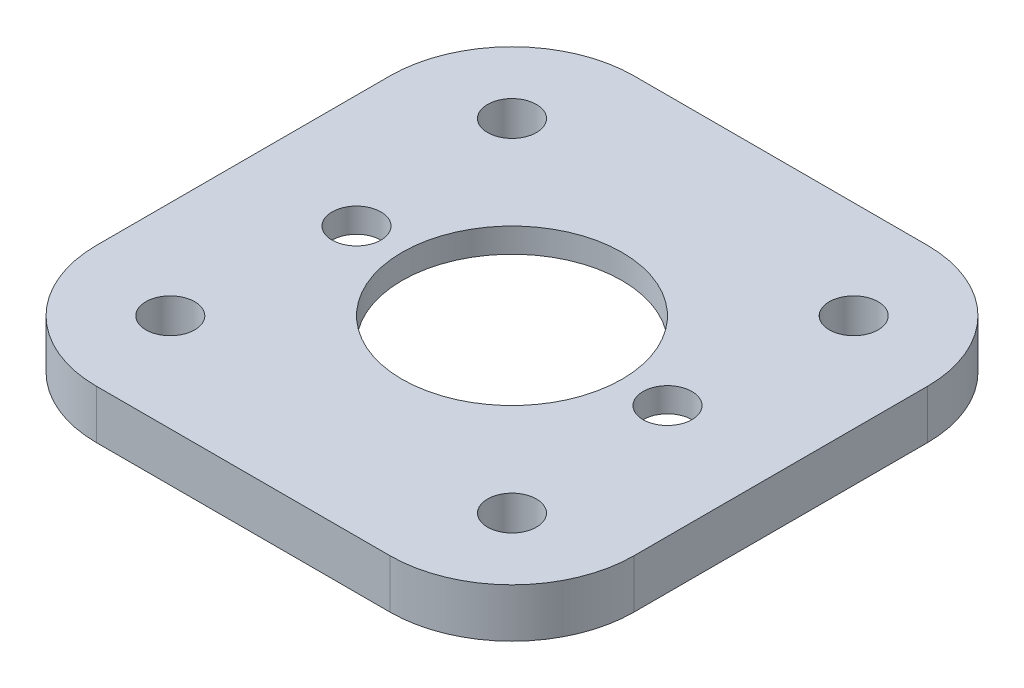
ISO-10303-21;
HEADER;
FILE_DESCRIPTION(('STEP AP214'),'2;1');
FILE_NAME('part.step','',(''),(''),'','','');
FILE_SCHEMA(('AUTOMOTIVE_DESIGN { 1 0 10303 214 1 1 1 1 }'));
ENDSEC;
DATA;
#1=APPLICATION_CONTEXT('core data for automotive mechanical design processes');
#2=APPLICATION_PROTOCOL_DEFINITION('international standard','automotive_design',2000,#1);
#3=PRODUCT_CONTEXT('',#1,'mechanical');
#4=PRODUCT('Part','Part','',(#3));
#5=PRODUCT_RELATED_PRODUCT_CATEGORY('part','',(#4));
#6=PRODUCT_DEFINITION_FORMATION('','',#4);
#7=PRODUCT_DEFINITION_CONTEXT('part definition',#1,'design');
#8=PRODUCT_DEFINITION('design','',#6,#7);
#9=PRODUCT_DEFINITION_SHAPE('','',#8);
#10=(LENGTH_UNIT() NAMED_UNIT(*) SI_UNIT(.MILLI.,.METRE.));
#11=(NAMED_UNIT(*) PLANE_ANGLE_UNIT() SI_UNIT($,.RADIAN.));
#12=(NAMED_UNIT(*) SI_UNIT($,.STERADIAN.) SOLID_ANGLE_UNIT());
#13=UNCERTAINTY_MEASURE_WITH_UNIT(LENGTH_MEASURE(1.E-05),#10,'distance_accuracy_value','');
#14=(GEOMETRIC_REPRESENTATION_CONTEXT(3) GLOBAL_UNCERTAINTY_ASSIGNED_CONTEXT((#13)) GLOBAL_UNIT_ASSIGNED_CONTEXT((#10,
#11,#12)) REPRESENTATION_CONTEXT('',''));
#15=CARTESIAN_POINT('',(0.,0.,0.));
#16=DIRECTION('',(0.,0.,1.));
#17=DIRECTION('',(1.,0.,0.));
#18=AXIS2_PLACEMENT_3D('',#15,#16,#17);
#19=CARTESIAN_POINT('',(0.,2.,-11.));
#20=DIRECTION('',(0.,0.,-1.));
#21=DIRECTION('',(-1.,0.,0.));
#22=AXIS2_PLACEMENT_3D('',#19,#20,#21);
#23=PLANE('',#22);
#24=DIRECTION('',(1.,0.,0.));
#25=VECTOR('',#24,1.);
#26=CARTESIAN_POINT('',(0.,0.,-11.));
#27=LINE('',#26,#25);
#28=CARTESIAN_POINT('',(-6.,0.,-11.));
#29=VERTEX_POINT('',#28);
#30=CARTESIAN_POINT('',(6.,0.,-11.));
#31=VERTEX_POINT('',#30);
#32=EDGE_CURVE('E169',#29,#31,#27,.T.);
#33=ORIENTED_EDGE('',*,*,#32,.F.);
#34=DIRECTION('',(0.,-1.,0.));
#35=VECTOR('',#34,1.);
#36=CARTESIAN_POINT('',(-6.,2.,-11.));
#37=LINE('',#36,#35);
#38=CARTESIAN_POINT('',(-6.,2.,-11.));
#39=VERTEX_POINT('',#38);
#40=EDGE_CURVE('E11',#39,#29,#37,.T.);
#41=ORIENTED_EDGE('',*,*,#40,.F.);
#42=DIRECTION('',(1.,0.,0.));
#43=VECTOR('',#42,1.);
#44=CARTESIAN_POINT('',(0.,2.,-11.));
#45=LINE('',#44,#43);
#46=CARTESIAN_POINT('',(6.,2.,-11.));
#47=VERTEX_POINT('',#46);
#48=EDGE_CURVE('E531',#39,#47,#45,.T.);
#49=ORIENTED_EDGE('',*,*,#48,.T.);
#50=DIRECTION('',(0.,-1.,0.));
#51=VECTOR('',#50,1.);
#52=CARTESIAN_POINT('',(6.,2.,-11.));
#53=LINE('',#52,#51);
#54=EDGE_CURVE('E63',#47,#31,#53,.T.);
#55=ORIENTED_EDGE('',*,*,#54,.T.);
#56=EDGE_LOOP('',(#33,#41,#49,#55));
#57=FACE_BOUND('',#56,.T.);
#58=ADVANCED_FACE('F39',(#57),#23,.T.);
#59=CARTESIAN_POINT('',(-6.,2.,-6.));
#60=DIRECTION('',(0.,-1.,0.));
#61=DIRECTION('',(0.,0.,-1.));
#62=AXIS2_PLACEMENT_3D('',#59,#60,#61);
#63=CYLINDRICAL_SURFACE('',#62,5.);
#64=CARTESIAN_POINT('',(-6.,0.,-6.));
#65=DIRECTION('',(0.,1.,0.));
#66=DIRECTION('',(0.,0.,1.));
#67=AXIS2_PLACEMENT_3D('',#64,#65,#66);
#68=CIRCLE('',#67,5.);
#69=CARTESIAN_POINT('',(-11.,0.,-6.));
#70=VERTEX_POINT('',#69);
#71=EDGE_CURVE('E171',#29,#70,#68,.T.);
#72=ORIENTED_EDGE('',*,*,#71,.T.);
#73=DIRECTION('',(0.,-1.,0.));
#74=VECTOR('',#73,1.);
#75=CARTESIAN_POINT('',(-11.,2.,-6.));
#76=LINE('',#75,#74);
#77=CARTESIAN_POINT('',(-11.,2.,-6.));
#78=VERTEX_POINT('',#77);
#79=EDGE_CURVE('E47',#78,#70,#76,.T.);
#80=ORIENTED_EDGE('',*,*,#79,.F.);
#81=CARTESIAN_POINT('',(-6.,2.,-6.));
#82=DIRECTION('',(0.,1.,0.));
#83=DIRECTION('',(0.,0.,1.));
#84=AXIS2_PLACEMENT_3D('',#81,#82,#83);
#85=CIRCLE('',#84,5.);
#86=EDGE_CURVE('E533',#39,#78,#85,.T.);
#87=ORIENTED_EDGE('',*,*,#86,.F.);
#88=ORIENTED_EDGE('',*,*,#40,.T.);
#89=EDGE_LOOP('',(#72,#80,#87,#88));
#90=FACE_BOUND('',#89,.T.);
#91=ADVANCED_FACE('F208',(#90),#63,.T.);
#92=CARTESIAN_POINT('',(-11.,2.,0.));
#93=DIRECTION('',(1.,0.,0.));
#94=DIRECTION('',(0.,0.,-1.));
#95=AXIS2_PLACEMENT_3D('',#92,#93,#94);
#96=PLANE('',#95);
#97=DIRECTION('',(0.,0.,1.));
#98=VECTOR('',#97,1.);
#99=CARTESIAN_POINT('',(-11.,0.,0.));
#100=LINE('',#99,#98);
#101=CARTESIAN_POINT('',(-11.,0.,6.));
#102=VERTEX_POINT('',#101);
#103=EDGE_CURVE('E174',#70,#102,#100,.T.);
#104=ORIENTED_EDGE('',*,*,#103,.T.);
#105=DIRECTION('',(0.,-1.,0.));
#106=VECTOR('',#105,1.);
#107=CARTESIAN_POINT('',(-11.,2.,6.));
#108=LINE('',#107,#106);
#109=CARTESIAN_POINT('',(-11.,2.,6.));
#110=VERTEX_POINT('',#109);
#111=EDGE_CURVE('E196',#110,#102,#108,.T.);
#112=ORIENTED_EDGE('',*,*,#111,.F.);
#113=DIRECTION('',(0.,0.,1.));
#114=VECTOR('',#113,1.);
#115=CARTESIAN_POINT('',(-11.,2.,0.));
#116=LINE('',#115,#114);
#117=EDGE_CURVE('E204',#78,#110,#116,.T.);
#118=ORIENTED_EDGE('',*,*,#117,.F.);
#119=ORIENTED_EDGE('',*,*,#79,.T.);
#120=EDGE_LOOP('',(#104,#112,#118,#119));
#121=FACE_BOUND('',#120,.T.);
#122=ADVANCED_FACE('F201',(#121),#96,.F.);
#123=CARTESIAN_POINT('',(-6.,2.,6.));
#124=DIRECTION('',(0.,-1.,0.));
#125=DIRECTION('',(0.,0.,-1.));
#126=AXIS2_PLACEMENT_3D('',#123,#124,#125);
#127=CYLINDRICAL_SURFACE('',#126,5.);
#128=CARTESIAN_POINT('',(-6.,0.,6.));
#129=DIRECTION('',(0.,1.,0.));
#130=DIRECTION('',(0.,0.,1.));
#131=AXIS2_PLACEMENT_3D('',#128,#129,#130);
#132=CIRCLE('',#131,5.);
#133=CARTESIAN_POINT('',(-6.,0.,11.));
#134=VERTEX_POINT('',#133);
#135=EDGE_CURVE('E177',#102,#134,#132,.T.);
#136=ORIENTED_EDGE('',*,*,#135,.T.);
#137=DIRECTION('',(0.,-1.,0.));
#138=VECTOR('',#137,1.);
#139=CARTESIAN_POINT('',(-6.,2.,11.));
#140=LINE('',#139,#138);
#141=CARTESIAN_POINT('',(-6.,2.,11.));
#142=VERTEX_POINT('',#141);
#143=EDGE_CURVE('E193',#142,#134,#140,.T.);
#144=ORIENTED_EDGE('',*,*,#143,.F.);
#145=CARTESIAN_POINT('',(-6.,2.,6.));
#146=DIRECTION('',(0.,1.,0.));
#147=DIRECTION('',(0.,0.,1.));
#148=AXIS2_PLACEMENT_3D('',#145,#146,#147);
#149=CIRCLE('',#148,5.);
#150=EDGE_CURVE('E536',#110,#142,#149,.T.);
#151=ORIENTED_EDGE('',*,*,#150,.F.);
#152=ORIENTED_EDGE('',*,*,#111,.T.);
#153=EDGE_LOOP('',(#136,#144,#151,#152));
#154=FACE_BOUND('',#153,.T.);
#155=ADVANCED_FACE('F282',(#154),#127,.T.);
#156=CARTESIAN_POINT('',(0.,2.,11.));
#157=DIRECTION('',(0.,0.,-1.));
#158=DIRECTION('',(-1.,0.,0.));
#159=AXIS2_PLACEMENT_3D('',#156,#157,#158);
#160=PLANE('',#159);
#161=DIRECTION('',(1.,0.,0.));
#162=VECTOR('',#161,1.);
#163=CARTESIAN_POINT('',(0.,0.,11.));
#164=LINE('',#163,#162);
#165=CARTESIAN_POINT('',(6.,0.,11.));
#166=VERTEX_POINT('',#165);
#167=EDGE_CURVE('E180',#134,#166,#164,.T.);
#168=ORIENTED_EDGE('',*,*,#167,.T.);
#169=DIRECTION('',(0.,-1.,0.));
#170=VECTOR('',#169,1.);
#171=CARTESIAN_POINT('',(6.,2.,11.));
#172=LINE('',#171,#170);
#173=CARTESIAN_POINT('',(6.,2.,11.));
#174=VERTEX_POINT('',#173);
#175=EDGE_CURVE('E138',#174,#166,#172,.T.);
#176=ORIENTED_EDGE('',*,*,#175,.F.);
#177=DIRECTION('',(1.,0.,0.));
#178=VECTOR('',#177,1.);
#179=CARTESIAN_POINT('',(0.,2.,11.));
#180=LINE('',#179,#178);
#181=EDGE_CURVE('E126',#142,#174,#180,.T.);
#182=ORIENTED_EDGE('',*,*,#181,.F.);
#183=ORIENTED_EDGE('',*,*,#143,.T.);
#184=EDGE_LOOP('',(#168,#176,#182,#183));
#185=FACE_BOUND('',#184,.T.);
#186=ADVANCED_FACE('F279',(#185),#160,.F.);
#187=CARTESIAN_POINT('',(6.,2.,6.));
#188=DIRECTION('',(0.,-1.,0.));
#189=DIRECTION('',(0.,0.,-1.));
#190=AXIS2_PLACEMENT_3D('',#187,#188,#189);
#191=CYLINDRICAL_SURFACE('',#190,5.);
#192=CARTESIAN_POINT('',(6.,0.,6.));
#193=DIRECTION('',(0.,1.,0.));
#194=DIRECTION('',(0.,0.,1.));
#195=AXIS2_PLACEMENT_3D('',#192,#193,#194);
#196=CIRCLE('',#195,5.);
#197=CARTESIAN_POINT('',(11.,0.,6.));
#198=VERTEX_POINT('',#197);
#199=EDGE_CURVE('E134',#166,#198,#196,.T.);
#200=ORIENTED_EDGE('',*,*,#199,.T.);
#201=DIRECTION('',(0.,-1.,0.));
#202=VECTOR('',#201,1.);
#203=CARTESIAN_POINT('',(11.,2.,6.));
#204=LINE('',#203,#202);
#205=CARTESIAN_POINT('',(11.,2.,6.));
#206=VERTEX_POINT('',#205);
#207=EDGE_CURVE('E132',#206,#198,#204,.T.);
#208=ORIENTED_EDGE('',*,*,#207,.F.);
#209=CARTESIAN_POINT('',(6.,2.,6.));
#210=DIRECTION('',(0.,1.,0.));
#211=DIRECTION('',(0.,0.,1.));
#212=AXIS2_PLACEMENT_3D('',#209,#210,#211);
#213=CIRCLE('',#212,5.);
#214=EDGE_CURVE('E117',#174,#206,#213,.T.);
#215=ORIENTED_EDGE('',*,*,#214,.F.);
#216=ORIENTED_EDGE('',*,*,#175,.T.);
#217=EDGE_LOOP('',(#200,#208,#215,#216));
#218=FACE_BOUND('',#217,.T.);
#219=ADVANCED_FACE('F133',(#218),#191,.T.);
#220=CARTESIAN_POINT('',(11.,2.,0.));
#221=DIRECTION('',(1.,0.,0.));
#222=DIRECTION('',(0.,0.,-1.));
#223=AXIS2_PLACEMENT_3D('',#220,#221,#222);
#224=PLANE('',#223);
#225=DIRECTION('',(0.,0.,1.));
#226=VECTOR('',#225,1.);
#227=CARTESIAN_POINT('',(11.,0.,0.));
#228=LINE('',#227,#226);
#229=CARTESIAN_POINT('',(11.,0.,-6.));
#230=VERTEX_POINT('',#229);
#231=EDGE_CURVE('E184',#230,#198,#228,.T.);
#232=ORIENTED_EDGE('',*,*,#231,.F.);
#233=DIRECTION('',(0.,-1.,0.));
#234=VECTOR('',#233,1.);
#235=CARTESIAN_POINT('',(11.,2.,-6.));
#236=LINE('',#235,#234);
#237=CARTESIAN_POINT('',(11.,2.,-6.));
#238=VERTEX_POINT('',#237);
#239=EDGE_CURVE('E139',#238,#230,#236,.T.);
#240=ORIENTED_EDGE('',*,*,#239,.F.);
#241=DIRECTION('',(0.,0.,1.));
#242=VECTOR('',#241,1.);
#243=CARTESIAN_POINT('',(11.,2.,0.));
#244=LINE('',#243,#242);
#245=EDGE_CURVE('E124',#238,#206,#244,.T.);
#246=ORIENTED_EDGE('',*,*,#245,.T.);
#247=ORIENTED_EDGE('',*,*,#207,.T.);
#248=EDGE_LOOP('',(#232,#240,#246,#247));
#249=FACE_BOUND('',#248,.T.);
#250=ADVANCED_FACE('F141',(#249),#224,.T.);
#251=CARTESIAN_POINT('',(-6.36396103067893,2.,0.));
#252=DIRECTION('',(0.,-1.,0.));
#253=DIRECTION('',(0.,0.,-1.));
#254=AXIS2_PLACEMENT_3D('',#251,#252,#253);
#255=CYLINDRICAL_SURFACE('',#254,1.);
#256=CARTESIAN_POINT('',(-6.36396103067893,1.,0.));
#257=DIRECTION('',(0.,1.,0.));
#258=DIRECTION('',(0.,0.,1.));
#259=AXIS2_PLACEMENT_3D('',#256,#257,#258);
#260=CIRCLE('',#259,1.);
#261=CARTESIAN_POINT('',(-6.36396103067893,1.,0.999999999999975));
#262=VERTEX_POINT('',#261);
#263=EDGE_CURVE('E451',#262,#262,#260,.T.);
#264=ORIENTED_EDGE('',*,*,#263,.F.);
#265=EDGE_LOOP('',(#264));
#266=FACE_BOUND('',#265,.T.);
#267=CARTESIAN_POINT('',(-6.36396103067893,2.,0.));
#268=DIRECTION('',(0.,1.,0.));
#269=DIRECTION('',(0.,0.,1.));
#270=AXIS2_PLACEMENT_3D('',#267,#268,#269);
#271=CIRCLE('',#270,1.);
#272=CARTESIAN_POINT('',(-6.36396103067893,2.,0.999999999999975));
#273=VERTEX_POINT('',#272);
#274=EDGE_CURVE('E150',#273,#273,#271,.T.);
#275=ORIENTED_EDGE('',*,*,#274,.T.);
#276=EDGE_LOOP('',(#275));
#277=FACE_BOUND('',#276,.T.);
#278=ADVANCED_FACE('F265',(#266,#277),#255,.F.);
#279=CARTESIAN_POINT('',(6.36396103067892,2.,0.));
#280=DIRECTION('',(0.,-1.,0.));
#281=DIRECTION('',(0.,0.,-1.));
#282=AXIS2_PLACEMENT_3D('',#279,#280,#281);
#283=CYLINDRICAL_SURFACE('',#282,1.);
#284=CARTESIAN_POINT('',(6.36396103067892,1.,0.));
#285=DIRECTION('',(0.,1.,0.));
#286=DIRECTION('',(0.,0.,1.));
#287=AXIS2_PLACEMENT_3D('',#284,#285,#286);
#288=CIRCLE('',#287,1.);
#289=CARTESIAN_POINT('',(6.36396103067892,1.,0.999999999999973));
#290=VERTEX_POINT('',#289);
#291=EDGE_CURVE('E447',#290,#290,#288,.T.);
#292=ORIENTED_EDGE('',*,*,#291,.F.);
#293=EDGE_LOOP('',(#292));
#294=FACE_BOUND('',#293,.T.);
#295=CARTESIAN_POINT('',(6.36396103067892,2.,0.));
#296=DIRECTION('',(0.,1.,0.));
#297=DIRECTION('',(0.,0.,1.));
#298=AXIS2_PLACEMENT_3D('',#295,#296,#297);
#299=CIRCLE('',#298,1.);
#300=CARTESIAN_POINT('',(6.36396103067892,2.,0.999999999999973));
#301=VERTEX_POINT('',#300);
#302=EDGE_CURVE('E144',#301,#301,#299,.T.);
#303=ORIENTED_EDGE('',*,*,#302,.T.);
#304=EDGE_LOOP('',(#303));
#305=FACE_BOUND('',#304,.T.);
#306=ADVANCED_FACE('F268',(#294,#305),#283,.F.);
#307=CARTESIAN_POINT('',(6.,2.,-6.));
#308=DIRECTION('',(0.,-1.,0.));
#309=DIRECTION('',(0.,0.,-1.));
#310=AXIS2_PLACEMENT_3D('',#307,#308,#309);
#311=CYLINDRICAL_SURFACE('',#310,5.);
#312=CARTESIAN_POINT('',(6.,0.,-6.));
#313=DIRECTION('',(0.,1.,0.));
#314=DIRECTION('',(0.,0.,1.));
#315=AXIS2_PLACEMENT_3D('',#312,#313,#314);
#316=CIRCLE('',#315,5.);
#317=EDGE_CURVE('E186',#31,#230,#316,.F.);
#318=ORIENTED_EDGE('',*,*,#317,.F.);
#319=ORIENTED_EDGE('',*,*,#54,.F.);
#320=CARTESIAN_POINT('',(6.,2.,-6.));
#321=DIRECTION('',(0.,1.,0.));
#322=DIRECTION('',(0.,0.,1.));
#323=AXIS2_PLACEMENT_3D('',#320,#321,#322);
#324=CIRCLE('',#323,5.);
#325=EDGE_CURVE('E142',#47,#238,#324,.F.);
#326=ORIENTED_EDGE('',*,*,#325,.T.);
#327=ORIENTED_EDGE('',*,*,#239,.T.);
#328=EDGE_LOOP('',(#318,#319,#326,#327));
#329=FACE_BOUND('',#328,.T.);
#330=ADVANCED_FACE('F223',(#329),#311,.T.);
#331=CARTESIAN_POINT('',(-6.99222187730034,2.,6.99222187730034));
#332=DIRECTION('',(0.,-1.,0.));
#333=DIRECTION('',(0.,0.,-1.));
#334=AXIS2_PLACEMENT_3D('',#331,#332,#333);
#335=CYLINDRICAL_SURFACE('',#334,1.);
#336=CARTESIAN_POINT('',(-6.99222187730034,2.,6.99222187730034));
#337=DIRECTION('',(0.,1.,0.));
#338=DIRECTION('',(0.,0.,1.));
#339=AXIS2_PLACEMENT_3D('',#336,#337,#338);
#340=CIRCLE('',#339,1.);
#341=CARTESIAN_POINT('',(-6.99222187730034,2.,7.99222187730034));
#342=VERTEX_POINT('',#341);
#343=EDGE_CURVE('E528',#342,#342,#340,.T.);
#344=ORIENTED_EDGE('',*,*,#343,.T.);
#345=EDGE_LOOP('',(#344));
#346=FACE_BOUND('',#345,.T.);
#347=CARTESIAN_POINT('',(-6.99222187730034,0.,6.99222187730034));
#348=DIRECTION('',(0.,1.,0.));
#349=DIRECTION('',(0.,0.,1.));
#350=AXIS2_PLACEMENT_3D('',#347,#348,#349);
#351=CIRCLE('',#350,1.);
#352=CARTESIAN_POINT('',(-6.99222187730034,0.,7.99222187730034));
#353=VERTEX_POINT('',#352);
#354=EDGE_CURVE('E166',#353,#353,#351,.T.);
#355=ORIENTED_EDGE('',*,*,#354,.F.);
#356=EDGE_LOOP('',(#355));
#357=FACE_BOUND('',#356,.T.);
#358=ADVANCED_FACE('F219',(#346,#357),#335,.F.);
#359=CARTESIAN_POINT('',(6.99222187730034,2.,6.99222187730034));
#360=DIRECTION('',(0.,-1.,0.));
#361=DIRECTION('',(0.,0.,-1.));
#362=AXIS2_PLACEMENT_3D('',#359,#360,#361);
#363=CYLINDRICAL_SURFACE('',#362,1.);
#364=CARTESIAN_POINT('',(6.99222187730034,2.,6.99222187730034));
#365=DIRECTION('',(0.,1.,0.));
#366=DIRECTION('',(0.,0.,1.));
#367=AXIS2_PLACEMENT_3D('',#364,#365,#366);
#368=CIRCLE('',#367,1.);
#369=CARTESIAN_POINT('',(6.99222187730034,2.,7.99222187730034));
#370=VERTEX_POINT('',#369);
#371=EDGE_CURVE('E525',#370,#370,#368,.T.);
#372=ORIENTED_EDGE('',*,*,#371,.T.);
#373=EDGE_LOOP('',(#372));
#374=FACE_BOUND('',#373,.T.);
#375=CARTESIAN_POINT('',(6.99222187730034,0.,6.99222187730034));
#376=DIRECTION('',(0.,1.,0.));
#377=DIRECTION('',(0.,0.,1.));
#378=AXIS2_PLACEMENT_3D('',#375,#376,#377);
#379=CIRCLE('',#378,1.);
#380=CARTESIAN_POINT('',(6.99222187730034,0.,7.99222187730034));
#381=VERTEX_POINT('',#380);
#382=EDGE_CURVE('E163',#381,#381,#379,.T.);
#383=ORIENTED_EDGE('',*,*,#382,.F.);
#384=EDGE_LOOP('',(#383));
#385=FACE_BOUND('',#384,.T.);
#386=ADVANCED_FACE('F222',(#374,#385),#363,.F.);
#387=CARTESIAN_POINT('',(6.99222187730034,2.,-6.99222187730033));
#388=DIRECTION('',(0.,-1.,0.));
#389=DIRECTION('',(0.,0.,-1.));
#390=AXIS2_PLACEMENT_3D('',#387,#388,#389);
#391=CYLINDRICAL_SURFACE('',#390,1.);
#392=CARTESIAN_POINT('',(6.99222187730034,2.,-6.99222187730033));
#393=DIRECTION('',(0.,1.,0.));
#394=DIRECTION('',(0.,0.,1.));
#395=AXIS2_PLACEMENT_3D('',#392,#393,#394);
#396=CIRCLE('',#395,1.);
#397=CARTESIAN_POINT('',(6.99222187730034,2.,-5.99222187730033));
#398=VERTEX_POINT('',#397);
#399=EDGE_CURVE('E238',#398,#398,#396,.T.);
#400=ORIENTED_EDGE('',*,*,#399,.T.);
#401=EDGE_LOOP('',(#400));
#402=FACE_BOUND('',#401,.T.);
#403=CARTESIAN_POINT('',(6.99222187730034,0.,-6.99222187730033));
#404=DIRECTION('',(0.,1.,0.));
#405=DIRECTION('',(0.,0.,1.));
#406=AXIS2_PLACEMENT_3D('',#403,#404,#405);
#407=CIRCLE('',#406,1.);
#408=CARTESIAN_POINT('',(6.99222187730034,0.,-5.99222187730033));
#409=VERTEX_POINT('',#408);
#410=EDGE_CURVE('E159',#409,#409,#407,.T.);
#411=ORIENTED_EDGE('',*,*,#410,.F.);
#412=EDGE_LOOP('',(#411));
#413=FACE_BOUND('',#412,.T.);
#414=ADVANCED_FACE('F226',(#402,#413),#391,.F.);
#415=CARTESIAN_POINT('',(-6.99222187730034,2.,-6.99222187730034));
#416=DIRECTION('',(0.,-1.,0.));
#417=DIRECTION('',(0.,0.,-1.));
#418=AXIS2_PLACEMENT_3D('',#415,#416,#417);
#419=CYLINDRICAL_SURFACE('',#418,1.);
#420=CARTESIAN_POINT('',(-6.99222187730034,2.,-6.99222187730034));
#421=DIRECTION('',(0.,1.,0.));
#422=DIRECTION('',(0.,0.,1.));
#423=AXIS2_PLACEMENT_3D('',#420,#421,#422);
#424=CIRCLE('',#423,1.);
#425=CARTESIAN_POINT('',(-6.99222187730034,2.,-5.99222187730034));
#426=VERTEX_POINT('',#425);
#427=EDGE_CURVE('E189',#426,#426,#424,.T.);
#428=ORIENTED_EDGE('',*,*,#427,.T.);
#429=EDGE_LOOP('',(#428));
#430=FACE_BOUND('',#429,.T.);
#431=CARTESIAN_POINT('',(-6.99222187730034,0.,-6.99222187730034));
#432=DIRECTION('',(0.,1.,0.));
#433=DIRECTION('',(0.,0.,1.));
#434=AXIS2_PLACEMENT_3D('',#431,#432,#433);
#435=CIRCLE('',#434,1.);
#436=CARTESIAN_POINT('',(-6.99222187730034,0.,-5.99222187730034));
#437=VERTEX_POINT('',#436);
#438=EDGE_CURVE('E156',#437,#437,#435,.T.);
#439=ORIENTED_EDGE('',*,*,#438,.F.);
#440=EDGE_LOOP('',(#439));
#441=FACE_BOUND('',#440,.T.);
#442=ADVANCED_FACE('F41',(#430,#441),#419,.F.);
#443=CARTESIAN_POINT('',(0.,2.,0.));
#444=DIRECTION('',(0.,-1.,0.));
#445=DIRECTION('',(0.,0.,-1.));
#446=AXIS2_PLACEMENT_3D('',#443,#444,#445);
#447=CYLINDRICAL_SURFACE('',#446,4.5);
#448=CARTESIAN_POINT('',(0.,1.,0.));
#449=DIRECTION('',(0.,1.,0.));
#450=DIRECTION('',(0.,0.,1.));
#451=AXIS2_PLACEMENT_3D('',#448,#449,#450);
#452=CIRCLE('',#451,4.5);
#453=CARTESIAN_POINT('',(0.,1.,4.5));
#454=VERTEX_POINT('',#453);
#455=EDGE_CURVE('E455',#454,#454,#452,.T.);
#456=ORIENTED_EDGE('',*,*,#455,.F.);
#457=EDGE_LOOP('',(#456));
#458=FACE_BOUND('',#457,.T.);
#459=CARTESIAN_POINT('',(0.,2.,0.));
#460=DIRECTION('',(0.,1.,0.));
#461=DIRECTION('',(0.,0.,1.));
#462=AXIS2_PLACEMENT_3D('',#459,#460,#461);
#463=CIRCLE('',#462,4.5);
#464=CARTESIAN_POINT('',(0.,2.,4.5));
#465=VERTEX_POINT('',#464);
#466=EDGE_CURVE('E153',#465,#465,#463,.T.);
#467=ORIENTED_EDGE('',*,*,#466,.T.);
#468=EDGE_LOOP('',(#467));
#469=FACE_BOUND('',#468,.T.);
#470=ADVANCED_FACE('F233',(#458,#469),#447,.F.);
#471=CARTESIAN_POINT('',(0.,2.,0.));
#472=DIRECTION('',(0.,1.,0.));
#473=DIRECTION('',(0.,0.,1.));
#474=AXIS2_PLACEMENT_3D('',#471,#472,#473);
#475=PLANE('',#474);
#476=ORIENTED_EDGE('',*,*,#427,.F.);
#477=EDGE_LOOP('',(#476));
#478=FACE_BOUND('',#477,.T.);
#479=ORIENTED_EDGE('',*,*,#399,.F.);
#480=EDGE_LOOP('',(#479));
#481=FACE_BOUND('',#480,.T.);
#482=ORIENTED_EDGE('',*,*,#371,.F.);
#483=EDGE_LOOP('',(#482));
#484=FACE_BOUND('',#483,.T.);
#485=ORIENTED_EDGE('',*,*,#343,.F.);
#486=EDGE_LOOP('',(#485));
#487=FACE_BOUND('',#486,.T.);
#488=ORIENTED_EDGE('',*,*,#48,.F.);
#489=ORIENTED_EDGE('',*,*,#86,.T.);
#490=ORIENTED_EDGE('',*,*,#117,.T.);
#491=ORIENTED_EDGE('',*,*,#150,.T.);
#492=ORIENTED_EDGE('',*,*,#181,.T.);
#493=ORIENTED_EDGE('',*,*,#214,.T.);
#494=ORIENTED_EDGE('',*,*,#245,.F.);
#495=ORIENTED_EDGE('',*,*,#325,.F.);
#496=EDGE_LOOP('',(#488,#489,#490,#491,#492,#493,#494,#495));
#497=FACE_BOUND('',#496,.T.);
#498=ORIENTED_EDGE('',*,*,#302,.F.);
#499=EDGE_LOOP('',(#498));
#500=FACE_BOUND('',#499,.T.);
#501=ORIENTED_EDGE('',*,*,#274,.F.);
#502=EDGE_LOOP('',(#501));
#503=FACE_BOUND('',#502,.T.);
#504=ORIENTED_EDGE('',*,*,#466,.F.);
#505=EDGE_LOOP('',(#504));
#506=FACE_BOUND('',#505,.T.);
#507=ADVANCED_FACE('F120',(#478,#481,#484,#487,#497,#500,#503,#506),#475,.T.);
#508=CARTESIAN_POINT('',(0.,0.,0.));
#509=DIRECTION('',(0.,1.,0.));
#510=DIRECTION('',(0.,0.,1.));
#511=AXIS2_PLACEMENT_3D('',#508,#509,#510);
#512=PLANE('',#511);
#513=CARTESIAN_POINT('',(7.07106781186548,0.,0.));
#514=DIRECTION('',(0.,1.,0.));
#515=DIRECTION('',(0.,0.,1.));
#516=AXIS2_PLACEMENT_3D('',#513,#514,#515);
#517=CIRCLE('',#516,3.);
#518=CARTESIAN_POINT('',(9.19238815542511,0.,-2.12132034355967));
#519=VERTEX_POINT('',#518);
#520=CARTESIAN_POINT('',(9.19238815542511,0.,2.12132034355965));
#521=VERTEX_POINT('',#520);
#522=EDGE_CURVE('E503',#519,#521,#517,.F.);
#523=ORIENTED_EDGE('',*,*,#522,.F.);
#524=DIRECTION('',(0.707106781186548,0.,0.707106781186547));
#525=VECTOR('',#524,1.);
#526=CARTESIAN_POINT('',(5.65685424949238,0.,-5.65685424949239));
#527=LINE('',#526,#525);
#528=CARTESIAN_POINT('',(2.12132034355964,0.,-9.19238815542512));
#529=VERTEX_POINT('',#528);
#530=EDGE_CURVE('E54',#529,#519,#527,.T.);
#531=ORIENTED_EDGE('',*,*,#530,.F.);
#532=CARTESIAN_POINT('',(0.,0.,-7.07106781186548));
#533=DIRECTION('',(0.,1.,0.));
#534=DIRECTION('',(0.,0.,1.));
#535=AXIS2_PLACEMENT_3D('',#532,#533,#534);
#536=CIRCLE('',#535,3.);
#537=CARTESIAN_POINT('',(-2.12132034355964,0.,-9.19238815542513));
#538=VERTEX_POINT('',#537);
#539=EDGE_CURVE('E485',#529,#538,#536,.T.);
#540=ORIENTED_EDGE('',*,*,#539,.T.);
#541=DIRECTION('',(-0.707106781186547,0.,0.707106781186548));
#542=VECTOR('',#541,1.);
#543=CARTESIAN_POINT('',(-5.65685424949239,0.,-5.65685424949238));
#544=LINE('',#543,#542);
#545=CARTESIAN_POINT('',(-9.19238815542511,0.,-2.12132034355965));
#546=VERTEX_POINT('',#545);
#547=EDGE_CURVE('E488',#538,#546,#544,.T.);
#548=ORIENTED_EDGE('',*,*,#547,.T.);
#549=CARTESIAN_POINT('',(-7.07106781186547,0.,0.));
#550=DIRECTION('',(0.,1.,0.));
#551=DIRECTION('',(0.,0.,1.));
#552=AXIS2_PLACEMENT_3D('',#549,#550,#551);
#553=CIRCLE('',#552,3.);
#554=CARTESIAN_POINT('',(-9.19238815542509,0.,2.12132034355965));
#555=VERTEX_POINT('',#554);
#556=EDGE_CURVE('E491',#546,#555,#553,.T.);
#557=ORIENTED_EDGE('',*,*,#556,.T.);
#558=DIRECTION('',(0.707106781186547,0.,0.707106781186548));
#559=VECTOR('',#558,1.);
#560=CARTESIAN_POINT('',(-5.65685424949237,0.,5.65685424949237));
#561=LINE('',#560,#559);
#562=CARTESIAN_POINT('',(-2.12132034355966,0.,9.19238815542509));
#563=VERTEX_POINT('',#562);
#564=EDGE_CURVE('E494',#555,#563,#561,.T.);
#565=ORIENTED_EDGE('',*,*,#564,.T.);
#566=CARTESIAN_POINT('',(0.,0.,7.07106781186546));
#567=DIRECTION('',(0.,1.,0.));
#568=DIRECTION('',(0.,0.,1.));
#569=AXIS2_PLACEMENT_3D('',#566,#567,#568);
#570=CIRCLE('',#569,3.);
#571=CARTESIAN_POINT('',(2.12132034355966,0.,9.19238815542509));
#572=VERTEX_POINT('',#571);
#573=EDGE_CURVE('E497',#563,#572,#570,.T.);
#574=ORIENTED_EDGE('',*,*,#573,.T.);
#575=DIRECTION('',(-0.707106781186548,0.,0.707106781186548));
#576=VECTOR('',#575,1.);
#577=CARTESIAN_POINT('',(5.65685424949238,0.,5.65685424949238));
#578=LINE('',#577,#576);
#579=EDGE_CURVE('E500',#521,#572,#578,.T.);
#580=ORIENTED_EDGE('',*,*,#579,.F.);
#581=EDGE_LOOP('',(#523,#531,#540,#548,#557,#565,#574,#580));
#582=FACE_BOUND('',#581,.T.);
#583=ORIENTED_EDGE('',*,*,#438,.T.);
#584=EDGE_LOOP('',(#583));
#585=FACE_BOUND('',#584,.T.);
#586=ORIENTED_EDGE('',*,*,#410,.T.);
#587=EDGE_LOOP('',(#586));
#588=FACE_BOUND('',#587,.T.);
#589=ORIENTED_EDGE('',*,*,#382,.T.);
#590=EDGE_LOOP('',(#589));
#591=FACE_BOUND('',#590,.T.);
#592=ORIENTED_EDGE('',*,*,#354,.T.);
#593=EDGE_LOOP('',(#592));
#594=FACE_BOUND('',#593,.T.);
#595=ORIENTED_EDGE('',*,*,#32,.T.);
#596=ORIENTED_EDGE('',*,*,#317,.T.);
#597=ORIENTED_EDGE('',*,*,#231,.T.);
#598=ORIENTED_EDGE('',*,*,#199,.F.);
#599=ORIENTED_EDGE('',*,*,#167,.F.);
#600=ORIENTED_EDGE('',*,*,#135,.F.);
#601=ORIENTED_EDGE('',*,*,#103,.F.);
#602=ORIENTED_EDGE('',*,*,#71,.F.);
#603=EDGE_LOOP('',(#595,#596,#597,#598,#599,#600,#601,#602));
#604=FACE_BOUND('',#603,.T.);
#605=ADVANCED_FACE('F210',(#582,#585,#588,#591,#594,#604),#512,.F.);
#606=CARTESIAN_POINT('',(5.65685424949238,1.,-5.65685424949239));
#607=DIRECTION('',(0.707106781186547,0.,-0.707106781186548));
#608=DIRECTION('',(-0.707106781186548,0.,-0.707106781186547));
#609=AXIS2_PLACEMENT_3D('',#606,#607,#608);
#610=PLANE('',#609);
#611=ORIENTED_EDGE('',*,*,#530,.T.);
#612=DIRECTION('',(0.,-1.,0.));
#613=VECTOR('',#612,1.);
#614=CARTESIAN_POINT('',(9.19238815542511,1.,-2.12132034355967));
#615=LINE('',#614,#613);
#616=CARTESIAN_POINT('',(9.19238815542511,1.,-2.12132034355967));
#617=VERTEX_POINT('',#616);
#618=EDGE_CURVE('E473',#617,#519,#615,.T.);
#619=ORIENTED_EDGE('',*,*,#618,.F.);
#620=DIRECTION('',(0.707106781186548,0.,0.707106781186547));
#621=VECTOR('',#620,1.);
#622=CARTESIAN_POINT('',(5.65685424949238,1.,-5.65685424949239));
#623=LINE('',#622,#621);
#624=CARTESIAN_POINT('',(2.12132034355964,1.,-9.19238815542512));
#625=VERTEX_POINT('',#624);
#626=EDGE_CURVE('E460',#625,#617,#623,.T.);
#627=ORIENTED_EDGE('',*,*,#626,.F.);
#628=DIRECTION('',(0.,-1.,0.));
#629=VECTOR('',#628,1.);
#630=CARTESIAN_POINT('',(2.12132034355964,1.,-9.19238815542512));
#631=LINE('',#630,#629);
#632=EDGE_CURVE('E160',#625,#529,#631,.T.);
#633=ORIENTED_EDGE('',*,*,#632,.T.);
#634=EDGE_LOOP('',(#611,#619,#627,#633));
#635=FACE_BOUND('',#634,.T.);
#636=ADVANCED_FACE('F243',(#635),#610,.F.);
#637=CARTESIAN_POINT('',(0.,1.,-7.07106781186548));
#638=DIRECTION('',(0.,-1.,0.));
#639=DIRECTION('',(0.,0.,-1.));
#640=AXIS2_PLACEMENT_3D('',#637,#638,#639);
#641=CYLINDRICAL_SURFACE('',#640,3.);
#642=ORIENTED_EDGE('',*,*,#539,.F.);
#643=ORIENTED_EDGE('',*,*,#632,.F.);
#644=CARTESIAN_POINT('',(0.,1.,-7.07106781186548));
#645=DIRECTION('',(0.,1.,0.));
#646=DIRECTION('',(0.,0.,1.));
#647=AXIS2_PLACEMENT_3D('',#644,#645,#646);
#648=CIRCLE('',#647,3.);
#649=CARTESIAN_POINT('',(-2.12132034355964,1.,-9.19238815542513));
#650=VERTEX_POINT('',#649);
#651=EDGE_CURVE('E468',#625,#650,#648,.T.);
#652=ORIENTED_EDGE('',*,*,#651,.T.);
#653=DIRECTION('',(0.,-1.,0.));
#654=VECTOR('',#653,1.);
#655=CARTESIAN_POINT('',(-2.12132034355964,1.,-9.19238815542513));
#656=LINE('',#655,#654);
#657=EDGE_CURVE('E518',#650,#538,#656,.T.);
#658=ORIENTED_EDGE('',*,*,#657,.T.);
#659=EDGE_LOOP('',(#642,#643,#652,#658));
#660=FACE_BOUND('',#659,.T.);
#661=ADVANCED_FACE('F255',(#660),#641,.F.);
#662=CARTESIAN_POINT('',(-5.65685424949239,1.,-5.65685424949238));
#663=DIRECTION('',(0.707106781186548,0.,0.707106781186547));
#664=DIRECTION('',(0.707106781186547,0.,-0.707106781186548));
#665=AXIS2_PLACEMENT_3D('',#662,#663,#664);
#666=PLANE('',#665);
#667=ORIENTED_EDGE('',*,*,#547,.F.);
#668=ORIENTED_EDGE('',*,*,#657,.F.);
#669=DIRECTION('',(-0.707106781186547,0.,0.707106781186548));
#670=VECTOR('',#669,1.);
#671=CARTESIAN_POINT('',(-5.65685424949239,1.,-5.65685424949238));
#672=LINE('',#671,#670);
#673=CARTESIAN_POINT('',(-9.19238815542511,1.,-2.12132034355965));
#674=VERTEX_POINT('',#673);
#675=EDGE_CURVE('E583',#650,#674,#672,.T.);
#676=ORIENTED_EDGE('',*,*,#675,.T.);
#677=DIRECTION('',(0.,-1.,0.));
#678=VECTOR('',#677,1.);
#679=CARTESIAN_POINT('',(-9.19238815542511,1.,-2.12132034355965));
#680=LINE('',#679,#678);
#681=EDGE_CURVE('E515',#674,#546,#680,.T.);
#682=ORIENTED_EDGE('',*,*,#681,.T.);
#683=EDGE_LOOP('',(#667,#668,#676,#682));
#684=FACE_BOUND('',#683,.T.);
#685=ADVANCED_FACE('F370',(#684),#666,.T.);
#686=CARTESIAN_POINT('',(-7.07106781186547,1.,0.));
#687=DIRECTION('',(0.,-1.,0.));
#688=DIRECTION('',(0.,0.,-1.));
#689=AXIS2_PLACEMENT_3D('',#686,#687,#688);
#690=CYLINDRICAL_SURFACE('',#689,3.);
#691=ORIENTED_EDGE('',*,*,#556,.F.);
#692=ORIENTED_EDGE('',*,*,#681,.F.);
#693=CARTESIAN_POINT('',(-7.07106781186547,1.,0.));
#694=DIRECTION('',(0.,1.,0.));
#695=DIRECTION('',(0.,0.,1.));
#696=AXIS2_PLACEMENT_3D('',#693,#694,#695);
#697=CIRCLE('',#696,3.);
#698=CARTESIAN_POINT('',(-9.19238815542509,1.,2.12132034355965));
#699=VERTEX_POINT('',#698);
#700=EDGE_CURVE('E585',#674,#699,#697,.T.);
#701=ORIENTED_EDGE('',*,*,#700,.T.);
#702=DIRECTION('',(0.,-1.,0.));
#703=VECTOR('',#702,1.);
#704=CARTESIAN_POINT('',(-9.19238815542509,1.,2.12132034355965));
#705=LINE('',#704,#703);
#706=EDGE_CURVE('E512',#699,#555,#705,.T.);
#707=ORIENTED_EDGE('',*,*,#706,.T.);
#708=EDGE_LOOP('',(#691,#692,#701,#707));
#709=FACE_BOUND('',#708,.T.);
#710=ADVANCED_FACE('F380',(#709),#690,.F.);
#711=CARTESIAN_POINT('',(-5.65685424949237,1.,5.65685424949237));
#712=DIRECTION('',(0.707106781186548,0.,-0.707106781186547));
#713=DIRECTION('',(-0.707106781186547,0.,-0.707106781186548));
#714=AXIS2_PLACEMENT_3D('',#711,#712,#713);
#715=PLANE('',#714);
#716=ORIENTED_EDGE('',*,*,#564,.F.);
#717=ORIENTED_EDGE('',*,*,#706,.F.);
#718=DIRECTION('',(0.707106781186547,0.,0.707106781186548));
#719=VECTOR('',#718,1.);
#720=CARTESIAN_POINT('',(-5.65685424949237,1.,5.65685424949237));
#721=LINE('',#720,#719);
#722=CARTESIAN_POINT('',(-2.12132034355966,1.,9.19238815542509));
#723=VERTEX_POINT('',#722);
#724=EDGE_CURVE('E591',#699,#723,#721,.T.);
#725=ORIENTED_EDGE('',*,*,#724,.T.);
#726=DIRECTION('',(0.,-1.,0.));
#727=VECTOR('',#726,1.);
#728=CARTESIAN_POINT('',(-2.12132034355966,1.,9.19238815542509));
#729=LINE('',#728,#727);
#730=EDGE_CURVE('E509',#723,#563,#729,.T.);
#731=ORIENTED_EDGE('',*,*,#730,.T.);
#732=EDGE_LOOP('',(#716,#717,#725,#731));
#733=FACE_BOUND('',#732,.T.);
#734=ADVANCED_FACE('F390',(#733),#715,.T.);
#735=CARTESIAN_POINT('',(0.,1.,7.07106781186546));
#736=DIRECTION('',(0.,-1.,0.));
#737=DIRECTION('',(0.,0.,-1.));
#738=AXIS2_PLACEMENT_3D('',#735,#736,#737);
#739=CYLINDRICAL_SURFACE('',#738,3.);
#740=ORIENTED_EDGE('',*,*,#573,.F.);
#741=ORIENTED_EDGE('',*,*,#730,.F.);
#742=CARTESIAN_POINT('',(0.,1.,7.07106781186546));
#743=DIRECTION('',(0.,1.,0.));
#744=DIRECTION('',(0.,0.,1.));
#745=AXIS2_PLACEMENT_3D('',#742,#743,#744);
#746=CIRCLE('',#745,3.);
#747=CARTESIAN_POINT('',(2.12132034355966,1.,9.19238815542509));
#748=VERTEX_POINT('',#747);
#749=EDGE_CURVE('E480',#723,#748,#746,.T.);
#750=ORIENTED_EDGE('',*,*,#749,.T.);
#751=DIRECTION('',(0.,-1.,0.));
#752=VECTOR('',#751,1.);
#753=CARTESIAN_POINT('',(2.12132034355966,1.,9.19238815542509));
#754=LINE('',#753,#752);
#755=EDGE_CURVE('E506',#748,#572,#754,.T.);
#756=ORIENTED_EDGE('',*,*,#755,.T.);
#757=EDGE_LOOP('',(#740,#741,#750,#756));
#758=FACE_BOUND('',#757,.T.);
#759=ADVANCED_FACE('F400',(#758),#739,.F.);
#760=CARTESIAN_POINT('',(5.65685424949238,1.,5.65685424949238));
#761=DIRECTION('',(0.707106781186547,0.,0.707106781186547));
#762=DIRECTION('',(0.707106781186548,0.,-0.707106781186548));
#763=AXIS2_PLACEMENT_3D('',#760,#761,#762);
#764=PLANE('',#763);
#765=ORIENTED_EDGE('',*,*,#579,.T.);
#766=ORIENTED_EDGE('',*,*,#755,.F.);
#767=DIRECTION('',(-0.707106781186548,0.,0.707106781186548));
#768=VECTOR('',#767,1.);
#769=CARTESIAN_POINT('',(5.65685424949238,1.,5.65685424949238));
#770=LINE('',#769,#768);
#771=CARTESIAN_POINT('',(9.19238815542511,1.,2.12132034355965));
#772=VERTEX_POINT('',#771);
#773=EDGE_CURVE('E477',#772,#748,#770,.T.);
#774=ORIENTED_EDGE('',*,*,#773,.F.);
#775=DIRECTION('',(0.,-1.,0.));
#776=VECTOR('',#775,1.);
#777=CARTESIAN_POINT('',(9.19238815542511,1.,2.12132034355965));
#778=LINE('',#777,#776);
#779=EDGE_CURVE('E475',#772,#521,#778,.T.);
#780=ORIENTED_EDGE('',*,*,#779,.T.);
#781=EDGE_LOOP('',(#765,#766,#774,#780));
#782=FACE_BOUND('',#781,.T.);
#783=ADVANCED_FACE('F410',(#782),#764,.F.);
#784=CARTESIAN_POINT('',(7.07106781186548,1.,0.));
#785=DIRECTION('',(0.,-1.,0.));
#786=DIRECTION('',(0.,0.,-1.));
#787=AXIS2_PLACEMENT_3D('',#784,#785,#786);
#788=CYLINDRICAL_SURFACE('',#787,3.);
#789=ORIENTED_EDGE('',*,*,#522,.T.);
#790=ORIENTED_EDGE('',*,*,#779,.F.);
#791=CARTESIAN_POINT('',(7.07106781186548,1.,0.));
#792=DIRECTION('',(0.,1.,0.));
#793=DIRECTION('',(0.,0.,1.));
#794=AXIS2_PLACEMENT_3D('',#791,#792,#793);
#795=CIRCLE('',#794,3.);
#796=EDGE_CURVE('E464',#617,#772,#795,.F.);
#797=ORIENTED_EDGE('',*,*,#796,.F.);
#798=ORIENTED_EDGE('',*,*,#618,.T.);
#799=EDGE_LOOP('',(#789,#790,#797,#798));
#800=FACE_BOUND('',#799,.T.);
#801=ADVANCED_FACE('F420',(#800),#788,.F.);
#802=CARTESIAN_POINT('',(0.,1.,0.));
#803=DIRECTION('',(0.,1.,0.));
#804=DIRECTION('',(0.,0.,1.));
#805=AXIS2_PLACEMENT_3D('',#802,#803,#804);
#806=PLANE('',#805);
#807=ORIENTED_EDGE('',*,*,#291,.T.);
#808=EDGE_LOOP('',(#807));
#809=FACE_BOUND('',#808,.T.);
#810=ORIENTED_EDGE('',*,*,#263,.T.);
#811=EDGE_LOOP('',(#810));
#812=FACE_BOUND('',#811,.T.);
#813=ORIENTED_EDGE('',*,*,#455,.T.);
#814=EDGE_LOOP('',(#813));
#815=FACE_BOUND('',#814,.T.);
#816=ORIENTED_EDGE('',*,*,#626,.T.);
#817=ORIENTED_EDGE('',*,*,#796,.T.);
#818=ORIENTED_EDGE('',*,*,#773,.T.);
#819=ORIENTED_EDGE('',*,*,#749,.F.);
#820=ORIENTED_EDGE('',*,*,#724,.F.);
#821=ORIENTED_EDGE('',*,*,#700,.F.);
#822=ORIENTED_EDGE('',*,*,#675,.F.);
#823=ORIENTED_EDGE('',*,*,#651,.F.);
#824=EDGE_LOOP('',(#816,#817,#818,#819,#820,#821,#822,#823));
#825=FACE_BOUND('',#824,.T.);
#826=ADVANCED_FACE('F430',(#809,#812,#815,#825),#806,.F.);
#827=CLOSED_SHELL('',(#58,#91,#122,#155,#186,#219,#250,#278,#306,#330,#358,#386,#414,#442,#470,
#507,#605,#636,#661,#685,#710,#734,#759,#783,#801,#826));
#828=MANIFOLD_SOLID_BREP('B2',#827);
#829=ADVANCED_BREP_SHAPE_REPRESENTATION('',(#18,#828),#14);
#830=SHAPE_DEFINITION_REPRESENTATION(#9,#829);
ENDSEC;
END-ISO-10303-21;
